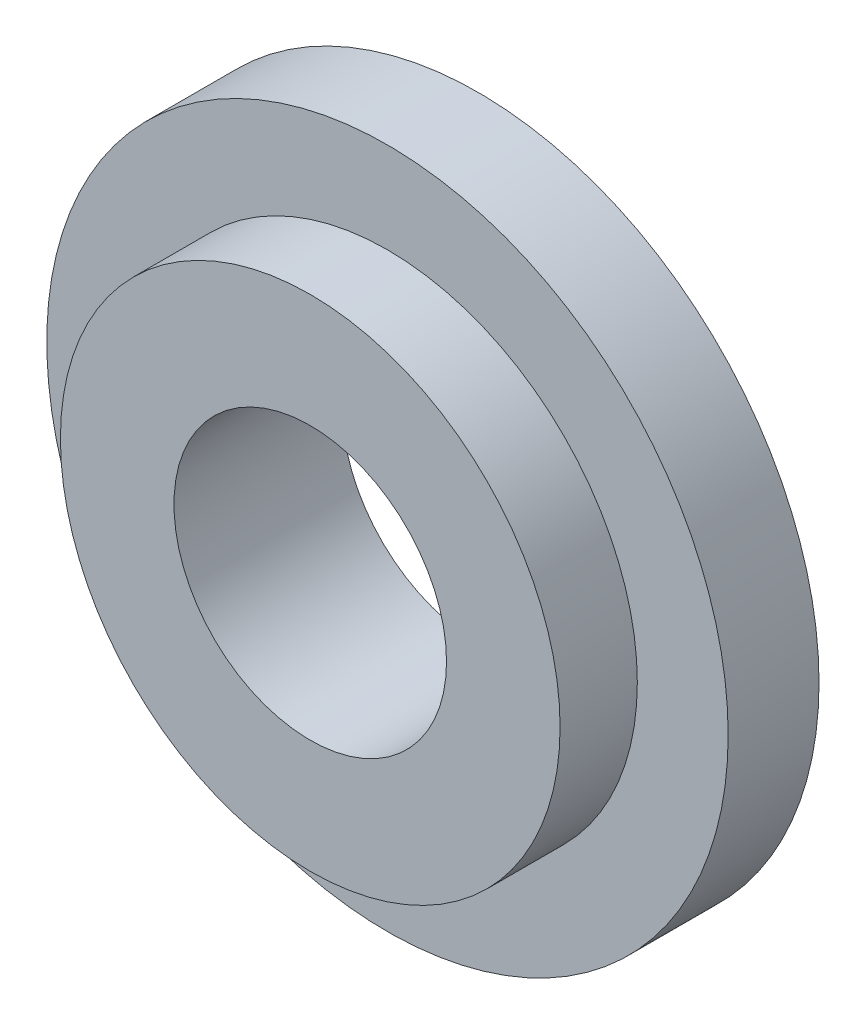
ISO-10303-21;
HEADER;
FILE_DESCRIPTION(('STEP AP214'),'2;1');
FILE_NAME('part.step','',(''),(''),'','','');
FILE_SCHEMA(('AUTOMOTIVE_DESIGN { 1 0 10303 214 1 1 1 1 }'));
ENDSEC;
DATA;
#1=APPLICATION_CONTEXT('core data for automotive mechanical design processes');
#2=APPLICATION_PROTOCOL_DEFINITION('international standard','automotive_design',2000,#1);
#3=PRODUCT_CONTEXT('',#1,'mechanical');
#4=PRODUCT('Part','Part','',(#3));
#5=PRODUCT_RELATED_PRODUCT_CATEGORY('part','',(#4));
#6=PRODUCT_DEFINITION_FORMATION('','',#4);
#7=PRODUCT_DEFINITION_CONTEXT('part definition',#1,'design');
#8=PRODUCT_DEFINITION('design','',#6,#7);
#9=PRODUCT_DEFINITION_SHAPE('','',#8);
#10=(LENGTH_UNIT() NAMED_UNIT(*) SI_UNIT(.MILLI.,.METRE.));
#11=(NAMED_UNIT(*) PLANE_ANGLE_UNIT() SI_UNIT($,.RADIAN.));
#12=(NAMED_UNIT(*) SI_UNIT($,.STERADIAN.) SOLID_ANGLE_UNIT());
#13=UNCERTAINTY_MEASURE_WITH_UNIT(LENGTH_MEASURE(1.E-05),#10,'distance_accuracy_value','');
#14=(GEOMETRIC_REPRESENTATION_CONTEXT(3) GLOBAL_UNCERTAINTY_ASSIGNED_CONTEXT((#13)) GLOBAL_UNIT_ASSIGNED_CONTEXT((#10,
#11,#12)) REPRESENTATION_CONTEXT('',''));
#15=CARTESIAN_POINT('',(0.,0.,0.));
#16=DIRECTION('',(0.,0.,1.));
#17=DIRECTION('',(1.,0.,0.));
#18=AXIS2_PLACEMENT_3D('',#15,#16,#17);
#19=CARTESIAN_POINT('',(0.,0.,1.));
#20=DIRECTION('',(0.,0.,-1.));
#21=DIRECTION('',(-1.,0.,0.));
#22=AXIS2_PLACEMENT_3D('',#19,#20,#21);
#23=CYLINDRICAL_SURFACE('',#22,3.75);
#24=CARTESIAN_POINT('',(0.,0.,1.));
#25=DIRECTION('',(0.,0.,1.));
#26=DIRECTION('',(1.,0.,0.));
#27=AXIS2_PLACEMENT_3D('',#24,#25,#26);
#28=CIRCLE('',#27,3.75);
#29=CARTESIAN_POINT('',(3.75,0.,1.));
#30=VERTEX_POINT('',#29);
#31=EDGE_CURVE('E41',#30,#30,#28,.T.);
#32=ORIENTED_EDGE('',*,*,#31,.F.);
#33=EDGE_LOOP('',(#32));
#34=FACE_BOUND('',#33,.T.);
#35=CARTESIAN_POINT('',(0.,0.,0.));
#36=DIRECTION('',(0.,0.,1.));
#37=DIRECTION('',(1.,0.,0.));
#38=AXIS2_PLACEMENT_3D('',#35,#36,#37);
#39=CIRCLE('',#38,3.75);
#40=CARTESIAN_POINT('',(3.75,0.,0.));
#41=VERTEX_POINT('',#40);
#42=EDGE_CURVE('E37',#41,#41,#39,.T.);
#43=ORIENTED_EDGE('',*,*,#42,.T.);
#44=EDGE_LOOP('',(#43));
#45=FACE_BOUND('',#44,.T.);
#46=ADVANCED_FACE('F34',(#34,#45),#23,.T.);
#47=CARTESIAN_POINT('',(0.,0.,1.));
#48=DIRECTION('',(0.,0.,1.));
#49=DIRECTION('',(1.,0.,0.));
#50=AXIS2_PLACEMENT_3D('',#47,#48,#49);
#51=PLANE('',#50);
#52=CARTESIAN_POINT('',(0.,0.,1.));
#53=DIRECTION('',(0.,0.,1.));
#54=DIRECTION('',(1.,0.,0.));
#55=AXIS2_PLACEMENT_3D('',#52,#53,#54);
#56=CIRCLE('',#55,2.75);
#57=CARTESIAN_POINT('',(2.75,0.,1.));
#58=VERTEX_POINT('',#57);
#59=EDGE_CURVE('E10',#58,#58,#56,.T.);
#60=ORIENTED_EDGE('',*,*,#59,.F.);
#61=EDGE_LOOP('',(#60));
#62=FACE_BOUND('',#61,.T.);
#63=ORIENTED_EDGE('',*,*,#31,.T.);
#64=EDGE_LOOP('',(#63));
#65=FACE_BOUND('',#64,.T.);
#66=ADVANCED_FACE('F78',(#62,#65),#51,.T.);
#67=CARTESIAN_POINT('',(0.,0.,0.));
#68=DIRECTION('',(0.,0.,1.));
#69=DIRECTION('',(1.,0.,0.));
#70=AXIS2_PLACEMENT_3D('',#67,#68,#69);
#71=PLANE('',#70);
#72=CARTESIAN_POINT('',(0.,0.,0.));
#73=DIRECTION('',(0.,0.,1.));
#74=DIRECTION('',(1.,0.,0.));
#75=AXIS2_PLACEMENT_3D('',#72,#73,#74);
#76=CIRCLE('',#75,1.5);
#77=CARTESIAN_POINT('',(1.5,0.,0.));
#78=VERTEX_POINT('',#77);
#79=EDGE_CURVE('E50',#78,#78,#76,.T.);
#80=ORIENTED_EDGE('',*,*,#79,.T.);
#81=EDGE_LOOP('',(#80));
#82=FACE_BOUND('',#81,.T.);
#83=ORIENTED_EDGE('',*,*,#42,.F.);
#84=EDGE_LOOP('',(#83));
#85=FACE_BOUND('',#84,.T.);
#86=ADVANCED_FACE('F57',(#82,#85),#71,.F.);
#87=CARTESIAN_POINT('',(0.,0.,1.85));
#88=DIRECTION('',(0.,0.,-1.));
#89=DIRECTION('',(-1.,0.,0.));
#90=AXIS2_PLACEMENT_3D('',#87,#88,#89);
#91=CYLINDRICAL_SURFACE('',#90,2.75);
#92=CARTESIAN_POINT('',(0.,0.,1.85));
#93=DIRECTION('',(0.,0.,1.));
#94=DIRECTION('',(1.,0.,0.));
#95=AXIS2_PLACEMENT_3D('',#92,#93,#94);
#96=CIRCLE('',#95,2.75);
#97=CARTESIAN_POINT('',(2.75,0.,1.85));
#98=VERTEX_POINT('',#97);
#99=EDGE_CURVE('E47',#98,#98,#96,.T.);
#100=ORIENTED_EDGE('',*,*,#99,.F.);
#101=EDGE_LOOP('',(#100));
#102=FACE_BOUND('',#101,.T.);
#103=ORIENTED_EDGE('',*,*,#59,.T.);
#104=EDGE_LOOP('',(#103));
#105=FACE_BOUND('',#104,.T.);
#106=ADVANCED_FACE('F69',(#102,#105),#91,.T.);
#107=CARTESIAN_POINT('',(0.,0.,1.85));
#108=DIRECTION('',(0.,0.,1.));
#109=DIRECTION('',(1.,0.,0.));
#110=AXIS2_PLACEMENT_3D('',#107,#108,#109);
#111=PLANE('',#110);
#112=CARTESIAN_POINT('',(0.,0.,1.85));
#113=DIRECTION('',(0.,0.,1.));
#114=DIRECTION('',(1.,0.,0.));
#115=AXIS2_PLACEMENT_3D('',#112,#113,#114);
#116=CIRCLE('',#115,1.5);
#117=CARTESIAN_POINT('',(1.5,0.,1.85));
#118=VERTEX_POINT('',#117);
#119=EDGE_CURVE('E51',#118,#118,#116,.T.);
#120=ORIENTED_EDGE('',*,*,#119,.F.);
#121=EDGE_LOOP('',(#120));
#122=FACE_BOUND('',#121,.T.);
#123=ORIENTED_EDGE('',*,*,#99,.T.);
#124=EDGE_LOOP('',(#123));
#125=FACE_BOUND('',#124,.T.);
#126=ADVANCED_FACE('F63',(#122,#125),#111,.T.);
#127=CARTESIAN_POINT('',(0.,0.,0.));
#128=DIRECTION('',(0.,0.,1.));
#129=DIRECTION('',(1.,0.,0.));
#130=AXIS2_PLACEMENT_3D('',#127,#128,#129);
#131=CYLINDRICAL_SURFACE('',#130,1.5);
#132=ORIENTED_EDGE('',*,*,#79,.F.);
#133=EDGE_LOOP('',(#132));
#134=FACE_BOUND('',#133,.T.);
#135=ORIENTED_EDGE('',*,*,#119,.T.);
#136=EDGE_LOOP('',(#135));
#137=FACE_BOUND('',#136,.T.);
#138=ADVANCED_FACE('F60',(#134,#137),#131,.F.);
#139=CLOSED_SHELL('',(#46,#66,#86,#106,#126,#138));
#140=MANIFOLD_SOLID_BREP('B2',#139);
#141=ADVANCED_BREP_SHAPE_REPRESENTATION('',(#18,#140),#14);
#142=SHAPE_DEFINITION_REPRESENTATION(#9,#141);
ENDSEC;
END-ISO-10303-21;
